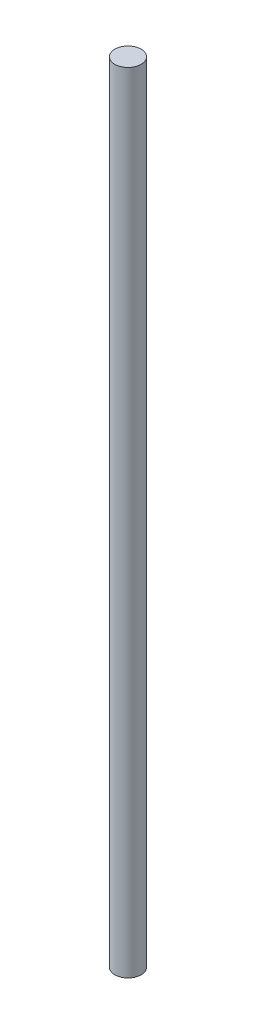
ISO-10303-21;
HEADER;
FILE_DESCRIPTION(('STEP AP214'),'2;1');
FILE_NAME('part.step','',(''),(''),'','','');
FILE_SCHEMA(('AUTOMOTIVE_DESIGN { 1 0 10303 214 1 1 1 1 }'));
ENDSEC;
DATA;
#1=APPLICATION_CONTEXT('core data for automotive mechanical design processes');
#2=APPLICATION_PROTOCOL_DEFINITION('international standard','automotive_design',2000,#1);
#3=PRODUCT_CONTEXT('',#1,'mechanical');
#4=PRODUCT('Part','Part','',(#3));
#5=PRODUCT_RELATED_PRODUCT_CATEGORY('part','',(#4));
#6=PRODUCT_DEFINITION_FORMATION('','',#4);
#7=PRODUCT_DEFINITION_CONTEXT('part definition',#1,'design');
#8=PRODUCT_DEFINITION('design','',#6,#7);
#9=PRODUCT_DEFINITION_SHAPE('','',#8);
#10=(LENGTH_UNIT() NAMED_UNIT(*) SI_UNIT(.MILLI.,.METRE.));
#11=(NAMED_UNIT(*) PLANE_ANGLE_UNIT() SI_UNIT($,.RADIAN.));
#12=(NAMED_UNIT(*) SI_UNIT($,.STERADIAN.) SOLID_ANGLE_UNIT());
#13=UNCERTAINTY_MEASURE_WITH_UNIT(LENGTH_MEASURE(1.E-05),#10,'distance_accuracy_value','');
#14=(GEOMETRIC_REPRESENTATION_CONTEXT(3) GLOBAL_UNCERTAINTY_ASSIGNED_CONTEXT((#13)) GLOBAL_UNIT_ASSIGNED_CONTEXT((#10,
#11,#12)) REPRESENTATION_CONTEXT('',''));
#15=CARTESIAN_POINT('',(0.,0.,0.));
#16=DIRECTION('',(0.,0.,1.));
#17=DIRECTION('',(1.,0.,0.));
#18=AXIS2_PLACEMENT_3D('',#15,#16,#17);
#19=CARTESIAN_POINT('',(0.,150.,0.));
#20=DIRECTION('',(0.,-1.,0.));
#21=DIRECTION('',(0.,0.,-1.));
#22=AXIS2_PLACEMENT_3D('',#19,#20,#21);
#23=CYLINDRICAL_SURFACE('',#22,2.5);
#24=CARTESIAN_POINT('',(0.,150.,0.));
#25=DIRECTION('',(0.,1.,0.));
#26=DIRECTION('',(0.,0.,1.));
#27=AXIS2_PLACEMENT_3D('',#24,#25,#26);
#28=CIRCLE('',#27,2.5);
#29=CARTESIAN_POINT('',(0.,150.,2.5));
#30=VERTEX_POINT('',#29);
#31=EDGE_CURVE('E10',#30,#30,#28,.T.);
#32=ORIENTED_EDGE('',*,*,#31,.F.);
#33=EDGE_LOOP('',(#32));
#34=FACE_BOUND('',#33,.T.);
#35=CARTESIAN_POINT('',(0.,0.,0.));
#36=DIRECTION('',(0.,1.,0.));
#37=DIRECTION('',(0.,0.,1.));
#38=AXIS2_PLACEMENT_3D('',#35,#36,#37);
#39=CIRCLE('',#38,2.5);
#40=CARTESIAN_POINT('',(0.,0.,2.5));
#41=VERTEX_POINT('',#40);
#42=EDGE_CURVE('E33',#41,#41,#39,.T.);
#43=ORIENTED_EDGE('',*,*,#42,.T.);
#44=EDGE_LOOP('',(#43));
#45=FACE_BOUND('',#44,.T.);
#46=ADVANCED_FACE('F30',(#34,#45),#23,.T.);
#47=CARTESIAN_POINT('',(0.,150.,0.));
#48=DIRECTION('',(0.,1.,0.));
#49=DIRECTION('',(0.,0.,1.));
#50=AXIS2_PLACEMENT_3D('',#47,#48,#49);
#51=PLANE('',#50);
#52=ORIENTED_EDGE('',*,*,#31,.T.);
#53=EDGE_LOOP('',(#52));
#54=FACE_BOUND('',#53,.T.);
#55=ADVANCED_FACE('F45',(#54),#51,.T.);
#56=CARTESIAN_POINT('',(0.,0.,0.));
#57=DIRECTION('',(0.,1.,0.));
#58=DIRECTION('',(0.,0.,1.));
#59=AXIS2_PLACEMENT_3D('',#56,#57,#58);
#60=PLANE('',#59);
#61=ORIENTED_EDGE('',*,*,#42,.F.);
#62=EDGE_LOOP('',(#61));
#63=FACE_BOUND('',#62,.T.);
#64=ADVANCED_FACE('F43',(#63),#60,.F.);
#65=CLOSED_SHELL('',(#46,#55,#64));
#66=MANIFOLD_SOLID_BREP('B2',#65);
#67=ADVANCED_BREP_SHAPE_REPRESENTATION('',(#18,#66),#14);
#68=SHAPE_DEFINITION_REPRESENTATION(#9,#67);
ENDSEC;
END-ISO-10303-21;
